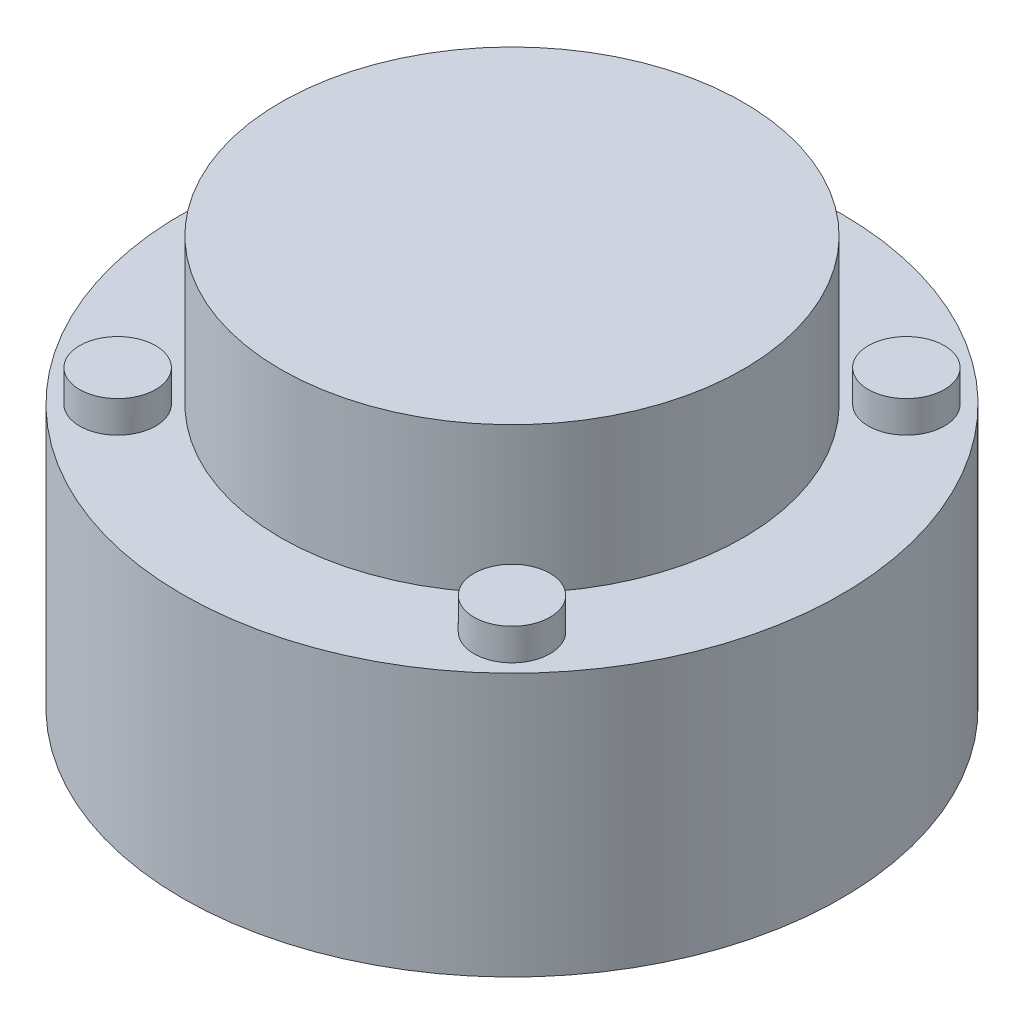
ISO-10303-21;
HEADER;
FILE_DESCRIPTION(('STEP AP214'),'2;1');
FILE_NAME('part.step','',(''),(''),'','','');
FILE_SCHEMA(('AUTOMOTIVE_DESIGN { 1 0 10303 214 1 1 1 1 }'));
ENDSEC;
DATA;
#1=APPLICATION_CONTEXT('core data for automotive mechanical design processes');
#2=APPLICATION_PROTOCOL_DEFINITION('international standard','automotive_design',2000,#1);
#3=PRODUCT_CONTEXT('',#1,'mechanical');
#4=PRODUCT('Part','Part','',(#3));
#5=PRODUCT_RELATED_PRODUCT_CATEGORY('part','',(#4));
#6=PRODUCT_DEFINITION_FORMATION('','',#4);
#7=PRODUCT_DEFINITION_CONTEXT('part definition',#1,'design');
#8=PRODUCT_DEFINITION('design','',#6,#7);
#9=PRODUCT_DEFINITION_SHAPE('','',#8);
#10=(LENGTH_UNIT() NAMED_UNIT(*) SI_UNIT(.MILLI.,.METRE.));
#11=(NAMED_UNIT(*) PLANE_ANGLE_UNIT() SI_UNIT($,.RADIAN.));
#12=(NAMED_UNIT(*) SI_UNIT($,.STERADIAN.) SOLID_ANGLE_UNIT());
#13=UNCERTAINTY_MEASURE_WITH_UNIT(LENGTH_MEASURE(1.E-05),#10,'distance_accuracy_value','');
#14=(GEOMETRIC_REPRESENTATION_CONTEXT(3) GLOBAL_UNCERTAINTY_ASSIGNED_CONTEXT((#13)) GLOBAL_UNIT_ASSIGNED_CONTEXT((#10,
#11,#12)) REPRESENTATION_CONTEXT('',''));
#15=CARTESIAN_POINT('',(0.,0.,0.));
#16=DIRECTION('',(0.,0.,1.));
#17=DIRECTION('',(1.,0.,0.));
#18=AXIS2_PLACEMENT_3D('',#15,#16,#17);
#19=CARTESIAN_POINT('',(26.,20.758,0.));
#20=DIRECTION('',(0.,-1.,0.));
#21=DIRECTION('',(0.,0.,-1.));
#22=AXIS2_PLACEMENT_3D('',#19,#20,#21);
#23=PLANE('',#22);
#24=CARTESIAN_POINT('',(15.556349186104,20.758,15.556349186104));
#25=DIRECTION('',(0.,-1.,0.));
#26=DIRECTION('',(0.,0.,-1.));
#27=AXIS2_PLACEMENT_3D('',#24,#25,#26);
#28=CIRCLE('',#27,3.);
#29=CARTESIAN_POINT('',(15.556349186104,20.758,12.556349186104));
#30=VERTEX_POINT('',#29);
#31=EDGE_CURVE('E38',#30,#30,#28,.F.);
#32=ORIENTED_EDGE('',*,*,#31,.F.);
#33=EDGE_LOOP('',(#32));
#34=FACE_BOUND('',#33,.T.);
#35=CARTESIAN_POINT('',(-15.556349186104,20.758,-15.556349186104));
#36=DIRECTION('',(0.,-1.,0.));
#37=DIRECTION('',(0.,0.,-1.));
#38=AXIS2_PLACEMENT_3D('',#35,#36,#37);
#39=CIRCLE('',#38,3.);
#40=CARTESIAN_POINT('',(-15.556349186104,20.758,-18.556349186104));
#41=VERTEX_POINT('',#40);
#42=EDGE_CURVE('E46',#41,#41,#39,.F.);
#43=ORIENTED_EDGE('',*,*,#42,.F.);
#44=EDGE_LOOP('',(#43));
#45=FACE_BOUND('',#44,.T.);
#46=CARTESIAN_POINT('',(0.,20.758,0.));
#47=DIRECTION('',(0.,1.,0.));
#48=DIRECTION('',(0.,0.,1.));
#49=AXIS2_PLACEMENT_3D('',#46,#47,#48);
#50=CIRCLE('',#49,18.25);
#51=CARTESIAN_POINT('',(0.,20.758,18.25));
#52=VERTEX_POINT('',#51);
#53=EDGE_CURVE('E57',#52,#52,#50,.T.);
#54=ORIENTED_EDGE('',*,*,#53,.F.);
#55=EDGE_LOOP('',(#54));
#56=FACE_BOUND('',#55,.T.);
#57=CARTESIAN_POINT('',(0.,20.758,0.));
#58=DIRECTION('',(0.,1.,0.));
#59=DIRECTION('',(0.,0.,1.));
#60=AXIS2_PLACEMENT_3D('',#57,#58,#59);
#61=CIRCLE('',#60,26.);
#62=CARTESIAN_POINT('',(0.,20.758,26.));
#63=VERTEX_POINT('',#62);
#64=EDGE_CURVE('E54',#63,#63,#61,.T.);
#65=ORIENTED_EDGE('',*,*,#64,.T.);
#66=EDGE_LOOP('',(#65));
#67=FACE_BOUND('',#66,.T.);
#68=CARTESIAN_POINT('',(15.556349186104,20.758,-15.556349186104));
#69=DIRECTION('',(0.,-1.,0.));
#70=DIRECTION('',(0.,0.,-1.));
#71=AXIS2_PLACEMENT_3D('',#68,#69,#70);
#72=CIRCLE('',#71,3.);
#73=CARTESIAN_POINT('',(15.556349186104,20.758,-18.556349186104));
#74=VERTEX_POINT('',#73);
#75=EDGE_CURVE('E42',#74,#74,#72,.F.);
#76=ORIENTED_EDGE('',*,*,#75,.F.);
#77=EDGE_LOOP('',(#76));
#78=FACE_BOUND('',#77,.T.);
#79=CARTESIAN_POINT('',(-15.556349186104,20.758,15.556349186104));
#80=DIRECTION('',(0.,-1.,0.));
#81=DIRECTION('',(0.,0.,-1.));
#82=AXIS2_PLACEMENT_3D('',#79,#80,#81);
#83=CIRCLE('',#82,3.);
#84=CARTESIAN_POINT('',(-15.556349186104,20.758,12.556349186104));
#85=VERTEX_POINT('',#84);
#86=EDGE_CURVE('E10',#85,#85,#83,.F.);
#87=ORIENTED_EDGE('',*,*,#86,.F.);
#88=EDGE_LOOP('',(#87));
#89=FACE_BOUND('',#88,.T.);
#90=ADVANCED_FACE('F31',(#34,#45,#56,#67,#78,#89),#23,.F.);
#91=CARTESIAN_POINT('',(0.,0.,0.));
#92=DIRECTION('',(0.,1.,0.));
#93=DIRECTION('',(0.,0.,1.));
#94=AXIS2_PLACEMENT_3D('',#91,#92,#93);
#95=PLANE('',#94);
#96=CARTESIAN_POINT('',(0.,0.,0.));
#97=DIRECTION('',(0.,1.,0.));
#98=DIRECTION('',(0.,0.,1.));
#99=AXIS2_PLACEMENT_3D('',#96,#97,#98);
#100=CIRCLE('',#99,26.);
#101=CARTESIAN_POINT('',(0.,0.,26.));
#102=VERTEX_POINT('',#101);
#103=EDGE_CURVE('E51',#102,#102,#100,.T.);
#104=ORIENTED_EDGE('',*,*,#103,.F.);
#105=EDGE_LOOP('',(#104));
#106=FACE_BOUND('',#105,.T.);
#107=ADVANCED_FACE('F33',(#106),#95,.F.);
#108=CARTESIAN_POINT('',(0.,32.258,0.));
#109=DIRECTION('',(0.,1.,0.));
#110=DIRECTION('',(0.,0.,1.));
#111=AXIS2_PLACEMENT_3D('',#108,#109,#110);
#112=CYLINDRICAL_SURFACE('',#111,26.);
#113=ORIENTED_EDGE('',*,*,#64,.F.);
#114=EDGE_LOOP('',(#113));
#115=FACE_BOUND('',#114,.T.);
#116=ORIENTED_EDGE('',*,*,#103,.T.);
#117=EDGE_LOOP('',(#116));
#118=FACE_BOUND('',#117,.T.);
#119=ADVANCED_FACE('F96',(#115,#118),#112,.T.);
#120=CARTESIAN_POINT('',(0.,32.258,0.));
#121=DIRECTION('',(0.,1.,0.));
#122=DIRECTION('',(0.,0.,1.));
#123=AXIS2_PLACEMENT_3D('',#120,#121,#122);
#124=CYLINDRICAL_SURFACE('',#123,18.25);
#125=CARTESIAN_POINT('',(0.,32.258,0.));
#126=DIRECTION('',(0.,1.,0.));
#127=DIRECTION('',(0.,0.,1.));
#128=AXIS2_PLACEMENT_3D('',#125,#126,#127);
#129=CIRCLE('',#128,18.25);
#130=CARTESIAN_POINT('',(0.,32.258,18.25));
#131=VERTEX_POINT('',#130);
#132=EDGE_CURVE('E60',#131,#131,#129,.T.);
#133=ORIENTED_EDGE('',*,*,#132,.F.);
#134=EDGE_LOOP('',(#133));
#135=FACE_BOUND('',#134,.T.);
#136=ORIENTED_EDGE('',*,*,#53,.T.);
#137=EDGE_LOOP('',(#136));
#138=FACE_BOUND('',#137,.T.);
#139=ADVANCED_FACE('F100',(#135,#138),#124,.T.);
#140=CARTESIAN_POINT('',(18.25,32.258,0.));
#141=DIRECTION('',(0.,-1.,0.));
#142=DIRECTION('',(0.,0.,-1.));
#143=AXIS2_PLACEMENT_3D('',#140,#141,#142);
#144=PLANE('',#143);
#145=ORIENTED_EDGE('',*,*,#132,.T.);
#146=EDGE_LOOP('',(#145));
#147=FACE_BOUND('',#146,.T.);
#148=ADVANCED_FACE('F107',(#147),#144,.F.);
#149=CARTESIAN_POINT('',(-15.556349186104,23.258,-15.556349186104));
#150=DIRECTION('',(0.,-1.,0.));
#151=DIRECTION('',(0.,0.,-1.));
#152=AXIS2_PLACEMENT_3D('',#149,#150,#151);
#153=CYLINDRICAL_SURFACE('',#152,3.);
#154=CARTESIAN_POINT('',(-15.556349186104,23.258,-15.556349186104));
#155=DIRECTION('',(0.,1.,0.));
#156=DIRECTION('',(0.,0.,1.));
#157=AXIS2_PLACEMENT_3D('',#154,#155,#156);
#158=CIRCLE('',#157,3.);
#159=CARTESIAN_POINT('',(-15.556349186104,23.258,-12.556349186104));
#160=VERTEX_POINT('',#159);
#161=EDGE_CURVE('E63',#160,#160,#158,.T.);
#162=ORIENTED_EDGE('',*,*,#161,.F.);
#163=EDGE_LOOP('',(#162));
#164=FACE_BOUND('',#163,.T.);
#165=ORIENTED_EDGE('',*,*,#42,.T.);
#166=EDGE_LOOP('',(#165));
#167=FACE_BOUND('',#166,.T.);
#168=ADVANCED_FACE('F129',(#164,#167),#153,.T.);
#169=CARTESIAN_POINT('',(-15.556349186104,23.258,-15.556349186104));
#170=DIRECTION('',(0.,1.,0.));
#171=DIRECTION('',(0.,0.,1.));
#172=AXIS2_PLACEMENT_3D('',#169,#170,#171);
#173=PLANE('',#172);
#174=ORIENTED_EDGE('',*,*,#161,.T.);
#175=EDGE_LOOP('',(#174));
#176=FACE_BOUND('',#175,.T.);
#177=ADVANCED_FACE('F120',(#176),#173,.T.);
#178=CARTESIAN_POINT('',(15.556349186104,23.258,-15.556349186104));
#179=DIRECTION('',(0.,-1.,0.));
#180=DIRECTION('',(0.,0.,-1.));
#181=AXIS2_PLACEMENT_3D('',#178,#179,#180);
#182=CYLINDRICAL_SURFACE('',#181,3.);
#183=CARTESIAN_POINT('',(15.556349186104,23.258,-15.556349186104));
#184=DIRECTION('',(0.,1.,0.));
#185=DIRECTION('',(0.,0.,1.));
#186=AXIS2_PLACEMENT_3D('',#183,#184,#185);
#187=CIRCLE('',#186,3.);
#188=CARTESIAN_POINT('',(15.556349186104,23.258,-12.556349186104));
#189=VERTEX_POINT('',#188);
#190=EDGE_CURVE('E66',#189,#189,#187,.T.);
#191=ORIENTED_EDGE('',*,*,#190,.F.);
#192=EDGE_LOOP('',(#191));
#193=FACE_BOUND('',#192,.T.);
#194=ORIENTED_EDGE('',*,*,#75,.T.);
#195=EDGE_LOOP('',(#194));
#196=FACE_BOUND('',#195,.T.);
#197=ADVANCED_FACE('F117',(#193,#196),#182,.T.);
#198=CARTESIAN_POINT('',(15.556349186104,23.258,-15.556349186104));
#199=DIRECTION('',(0.,1.,0.));
#200=DIRECTION('',(0.,0.,1.));
#201=AXIS2_PLACEMENT_3D('',#198,#199,#200);
#202=PLANE('',#201);
#203=ORIENTED_EDGE('',*,*,#190,.T.);
#204=EDGE_LOOP('',(#203));
#205=FACE_BOUND('',#204,.T.);
#206=ADVANCED_FACE('F119',(#205),#202,.T.);
#207=CARTESIAN_POINT('',(15.556349186104,23.258,15.556349186104));
#208=DIRECTION('',(0.,-1.,0.));
#209=DIRECTION('',(0.,0.,-1.));
#210=AXIS2_PLACEMENT_3D('',#207,#208,#209);
#211=CYLINDRICAL_SURFACE('',#210,3.);
#212=CARTESIAN_POINT('',(15.556349186104,23.258,15.556349186104));
#213=DIRECTION('',(0.,1.,0.));
#214=DIRECTION('',(0.,0.,1.));
#215=AXIS2_PLACEMENT_3D('',#212,#213,#214);
#216=CIRCLE('',#215,3.);
#217=CARTESIAN_POINT('',(15.556349186104,23.258,18.556349186104));
#218=VERTEX_POINT('',#217);
#219=EDGE_CURVE('E69',#218,#218,#216,.T.);
#220=ORIENTED_EDGE('',*,*,#219,.F.);
#221=EDGE_LOOP('',(#220));
#222=FACE_BOUND('',#221,.T.);
#223=ORIENTED_EDGE('',*,*,#31,.T.);
#224=EDGE_LOOP('',(#223));
#225=FACE_BOUND('',#224,.T.);
#226=ADVANCED_FACE('F87',(#222,#225),#211,.T.);
#227=CARTESIAN_POINT('',(15.556349186104,23.258,15.556349186104));
#228=DIRECTION('',(0.,1.,0.));
#229=DIRECTION('',(0.,0.,1.));
#230=AXIS2_PLACEMENT_3D('',#227,#228,#229);
#231=PLANE('',#230);
#232=ORIENTED_EDGE('',*,*,#219,.T.);
#233=EDGE_LOOP('',(#232));
#234=FACE_BOUND('',#233,.T.);
#235=ADVANCED_FACE('F80',(#234),#231,.T.);
#236=CARTESIAN_POINT('',(-15.556349186104,23.258,15.556349186104));
#237=DIRECTION('',(0.,-1.,0.));
#238=DIRECTION('',(0.,0.,-1.));
#239=AXIS2_PLACEMENT_3D('',#236,#237,#238);
#240=CYLINDRICAL_SURFACE('',#239,3.);
#241=CARTESIAN_POINT('',(-15.556349186104,23.258,15.556349186104));
#242=DIRECTION('',(0.,1.,0.));
#243=DIRECTION('',(0.,0.,1.));
#244=AXIS2_PLACEMENT_3D('',#241,#242,#243);
#245=CIRCLE('',#244,3.);
#246=CARTESIAN_POINT('',(-15.556349186104,23.258,18.556349186104));
#247=VERTEX_POINT('',#246);
#248=EDGE_CURVE('E72',#247,#247,#245,.T.);
#249=ORIENTED_EDGE('',*,*,#248,.F.);
#250=EDGE_LOOP('',(#249));
#251=FACE_BOUND('',#250,.T.);
#252=ORIENTED_EDGE('',*,*,#86,.T.);
#253=EDGE_LOOP('',(#252));
#254=FACE_BOUND('',#253,.T.);
#255=ADVANCED_FACE('F78',(#251,#254),#240,.T.);
#256=CARTESIAN_POINT('',(-15.556349186104,23.258,15.556349186104));
#257=DIRECTION('',(0.,1.,0.));
#258=DIRECTION('',(0.,0.,1.));
#259=AXIS2_PLACEMENT_3D('',#256,#257,#258);
#260=PLANE('',#259);
#261=ORIENTED_EDGE('',*,*,#248,.T.);
#262=EDGE_LOOP('',(#261));
#263=FACE_BOUND('',#262,.T.);
#264=ADVANCED_FACE('F76',(#263),#260,.T.);
#265=CLOSED_SHELL('',(#90,#107,#119,#139,#148,#168,#177,#197,#206,#226,#235,#255,#264));
#266=MANIFOLD_SOLID_BREP('B2',#265);
#267=ADVANCED_BREP_SHAPE_REPRESENTATION('',(#18,#266),#14);
#268=SHAPE_DEFINITION_REPRESENTATION(#9,#267);
ENDSEC;
END-ISO-10303-21;
